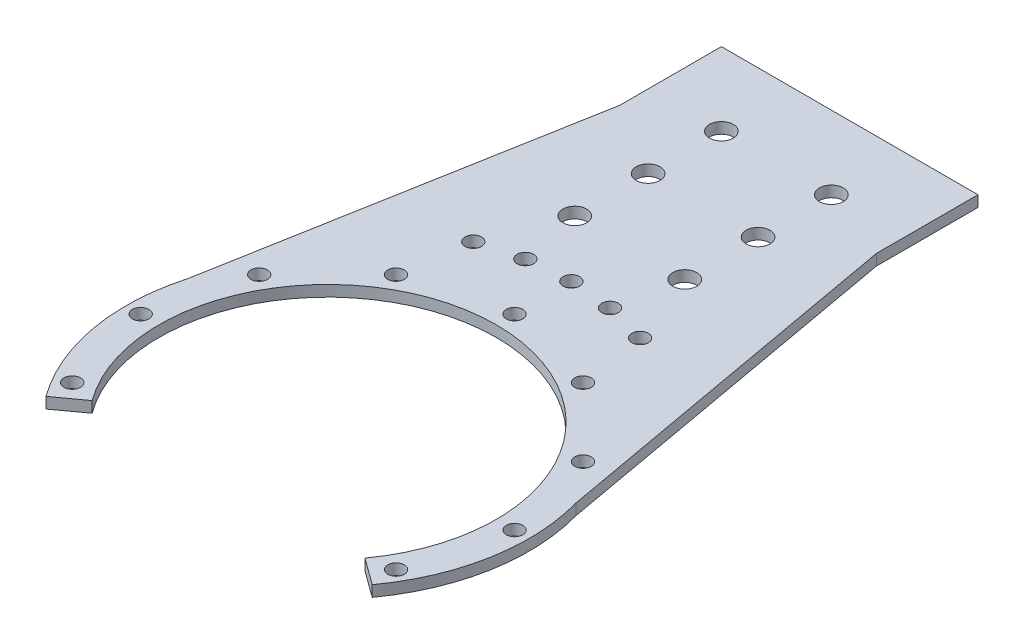
ISO-10303-21;
HEADER;
FILE_DESCRIPTION(('STEP AP214'),'2;1');
FILE_NAME('part.step','',(''),(''),'','','');
FILE_SCHEMA(('AUTOMOTIVE_DESIGN { 1 0 10303 214 1 1 1 1 }'));
ENDSEC;
DATA;
#1=APPLICATION_CONTEXT('core data for automotive mechanical design processes');
#2=APPLICATION_PROTOCOL_DEFINITION('international standard','automotive_design',2000,#1);
#3=PRODUCT_CONTEXT('',#1,'mechanical');
#4=PRODUCT('Part','Part','',(#3));
#5=PRODUCT_RELATED_PRODUCT_CATEGORY('part','',(#4));
#6=PRODUCT_DEFINITION_FORMATION('','',#4);
#7=PRODUCT_DEFINITION_CONTEXT('part definition',#1,'design');
#8=PRODUCT_DEFINITION('design','',#6,#7);
#9=PRODUCT_DEFINITION_SHAPE('','',#8);
#10=(LENGTH_UNIT() NAMED_UNIT(*) SI_UNIT(.MILLI.,.METRE.));
#11=(NAMED_UNIT(*) PLANE_ANGLE_UNIT() SI_UNIT($,.RADIAN.));
#12=(NAMED_UNIT(*) SI_UNIT($,.STERADIAN.) SOLID_ANGLE_UNIT());
#13=UNCERTAINTY_MEASURE_WITH_UNIT(LENGTH_MEASURE(1.E-05),#10,'distance_accuracy_value','');
#14=(GEOMETRIC_REPRESENTATION_CONTEXT(3) GLOBAL_UNCERTAINTY_ASSIGNED_CONTEXT((#13)) GLOBAL_UNIT_ASSIGNED_CONTEXT((#10,
#11,#12)) REPRESENTATION_CONTEXT('',''));
#15=CARTESIAN_POINT('',(0.,0.,0.));
#16=DIRECTION('',(0.,0.,1.));
#17=DIRECTION('',(1.,0.,0.));
#18=AXIS2_PLACEMENT_3D('',#15,#16,#17);
#19=CARTESIAN_POINT('',(-15.,-0.000287499999999594,-82.4264068711929));
#20=DIRECTION('',(0.,1.,0.));
#21=DIRECTION('',(0.,0.,1.));
#22=AXIS2_PLACEMENT_3D('',#19,#20,#21);
#23=CYLINDRICAL_SURFACE('',#22,3.25);
#24=CARTESIAN_POINT('',(-15.,3.,-82.4264068711929));
#25=DIRECTION('',(0.,1.,0.));
#26=DIRECTION('',(0.,0.,1.));
#27=AXIS2_PLACEMENT_3D('',#24,#25,#26);
#28=CIRCLE('',#27,3.25);
#29=CARTESIAN_POINT('',(-15.,3.,-79.1764068711929));
#30=VERTEX_POINT('',#29);
#31=EDGE_CURVE('E41',#30,#30,#28,.T.);
#32=ORIENTED_EDGE('',*,*,#31,.T.);
#33=EDGE_LOOP('',(#32));
#34=FACE_BOUND('',#33,.T.);
#35=CARTESIAN_POINT('',(-15.,0.,-82.4264068711929));
#36=DIRECTION('',(0.,1.,0.));
#37=DIRECTION('',(0.,0.,1.));
#38=AXIS2_PLACEMENT_3D('',#35,#36,#37);
#39=CIRCLE('',#38,3.25);
#40=CARTESIAN_POINT('',(-15.,0.,-79.1764068711929));
#41=VERTEX_POINT('',#40);
#42=EDGE_CURVE('E11',#41,#41,#39,.T.);
#43=ORIENTED_EDGE('',*,*,#42,.F.);
#44=EDGE_LOOP('',(#43));
#45=FACE_BOUND('',#44,.T.);
#46=ADVANCED_FACE('F33',(#34,#45),#23,.F.);
#47=CARTESIAN_POINT('',(15.,-0.000287499999999594,-82.4264068711929));
#48=DIRECTION('',(0.,1.,0.));
#49=DIRECTION('',(0.,0.,1.));
#50=AXIS2_PLACEMENT_3D('',#47,#48,#49);
#51=CYLINDRICAL_SURFACE('',#50,3.25);
#52=CARTESIAN_POINT('',(15.,3.,-82.4264068711929));
#53=DIRECTION('',(0.,1.,0.));
#54=DIRECTION('',(0.,0.,1.));
#55=AXIS2_PLACEMENT_3D('',#52,#53,#54);
#56=CIRCLE('',#55,3.25);
#57=CARTESIAN_POINT('',(15.,3.,-79.1764068711929));
#58=VERTEX_POINT('',#57);
#59=EDGE_CURVE('E159',#58,#58,#56,.T.);
#60=ORIENTED_EDGE('',*,*,#59,.T.);
#61=EDGE_LOOP('',(#60));
#62=FACE_BOUND('',#61,.T.);
#63=CARTESIAN_POINT('',(15.,0.,-82.4264068711929));
#64=DIRECTION('',(0.,1.,0.));
#65=DIRECTION('',(0.,0.,1.));
#66=AXIS2_PLACEMENT_3D('',#63,#64,#65);
#67=CIRCLE('',#66,3.25);
#68=CARTESIAN_POINT('',(15.,0.,-79.1764068711929));
#69=VERTEX_POINT('',#68);
#70=EDGE_CURVE('E161',#69,#69,#67,.T.);
#71=ORIENTED_EDGE('',*,*,#70,.F.);
#72=EDGE_LOOP('',(#71));
#73=FACE_BOUND('',#72,.T.);
#74=ADVANCED_FACE('F356',(#62,#73),#51,.F.);
#75=CARTESIAN_POINT('',(0.,3.,0.));
#76=DIRECTION('',(0.,-1.,0.));
#77=DIRECTION('',(0.,0.,-1.));
#78=AXIS2_PLACEMENT_3D('',#75,#76,#77);
#79=CYLINDRICAL_SURFACE('',#78,55.);
#80=DIRECTION('',(0.,1.,0.));
#81=VECTOR('',#80,1.);
#82=CARTESIAN_POINT('',(44.4959346906222,-2.49999999998515E-05,32.328188876086));
#83=LINE('',#82,#81);
#84=CARTESIAN_POINT('',(44.4959346906222,-6.24999999996288E-06,32.328188876086));
#85=VERTEX_POINT('',#84);
#86=CARTESIAN_POINT('',(44.4959346906222,3.,32.328188876086));
#87=VERTEX_POINT('',#86);
#88=EDGE_CURVE('E111',#85,#87,#83,.T.);
#89=ORIENTED_EDGE('',*,*,#88,.F.);
#90=CARTESIAN_POINT('',(0.,0.,0.));
#91=DIRECTION('',(0.,1.,0.));
#92=DIRECTION('',(0.,0.,1.));
#93=AXIS2_PLACEMENT_3D('',#90,#91,#92);
#94=CIRCLE('',#93,55.);
#95=CARTESIAN_POINT('',(52.9848805263081,0.,-14.7513536874709));
#96=VERTEX_POINT('',#95);
#97=EDGE_CURVE('E141',#85,#96,#94,.T.);
#98=ORIENTED_EDGE('',*,*,#97,.T.);
#99=DIRECTION('',(0.,-1.,0.));
#100=VECTOR('',#99,1.);
#101=CARTESIAN_POINT('',(52.9848805263081,3.,-14.7513536874709));
#102=LINE('',#101,#100);
#103=CARTESIAN_POINT('',(52.9848805263081,3.,-14.7513536874709));
#104=VERTEX_POINT('',#103);
#105=EDGE_CURVE('E132',#104,#96,#102,.T.);
#106=ORIENTED_EDGE('',*,*,#105,.F.);
#107=CARTESIAN_POINT('',(0.,3.,0.));
#108=DIRECTION('',(0.,1.,0.));
#109=DIRECTION('',(0.,0.,1.));
#110=AXIS2_PLACEMENT_3D('',#107,#108,#109);
#111=CIRCLE('',#110,55.);
#112=EDGE_CURVE('E124',#87,#104,#111,.T.);
#113=ORIENTED_EDGE('',*,*,#112,.F.);
#114=EDGE_LOOP('',(#89,#98,#106,#113));
#115=FACE_BOUND('',#114,.T.);
#116=ADVANCED_FACE('F130',(#115),#79,.T.);
#117=CARTESIAN_POINT('',(0.,3.,0.));
#118=DIRECTION('',(0.,1.,0.));
#119=DIRECTION('',(0.,0.,1.));
#120=AXIS2_PLACEMENT_3D('',#117,#118,#119);
#121=PLANE('',#120);
#122=CARTESIAN_POINT('',(22.744339531157,3.,-62.4895592822629));
#123=DIRECTION('',(0.,1.,0.));
#124=DIRECTION('',(0.,0.,1.));
#125=AXIS2_PLACEMENT_3D('',#122,#123,#124);
#126=CIRCLE('',#125,2.25);
#127=CARTESIAN_POINT('',(22.744339531157,3.,-60.2395592822629));
#128=VERTEX_POINT('',#127);
#129=EDGE_CURVE('E177',#128,#128,#126,.T.);
#130=ORIENTED_EDGE('',*,*,#129,.F.);
#131=EDGE_LOOP('',(#130));
#132=FACE_BOUND('',#131,.T.);
#133=CARTESIAN_POINT('',(11.5476038148509,3.,-65.4897155753118));
#134=DIRECTION('',(0.,1.,0.));
#135=DIRECTION('',(0.,0.,1.));
#136=AXIS2_PLACEMENT_3D('',#133,#134,#135);
#137=CIRCLE('',#136,2.25);
#138=CARTESIAN_POINT('',(11.5476038148509,3.,-63.2397155753118));
#139=VERTEX_POINT('',#138);
#140=EDGE_CURVE('E187',#139,#139,#137,.T.);
#141=ORIENTED_EDGE('',*,*,#140,.F.);
#142=EDGE_LOOP('',(#141));
#143=FACE_BOUND('',#142,.T.);
#144=CARTESIAN_POINT('',(-22.744339531157,3.,-62.4895592822629));
#145=DIRECTION('',(0.,1.,0.));
#146=DIRECTION('',(0.,0.,1.));
#147=AXIS2_PLACEMENT_3D('',#144,#145,#146);
#148=CIRCLE('',#147,2.25);
#149=CARTESIAN_POINT('',(-22.744339531157,3.,-60.2395592822629));
#150=VERTEX_POINT('',#149);
#151=EDGE_CURVE('E184',#150,#150,#148,.T.);
#152=ORIENTED_EDGE('',*,*,#151,.F.);
#153=EDGE_LOOP('',(#152));
#154=FACE_BOUND('',#153,.T.);
#155=CARTESIAN_POINT('',(-11.5476038148509,3.,-65.4897155753118));
#156=DIRECTION('',(0.,1.,0.));
#157=DIRECTION('',(0.,0.,1.));
#158=AXIS2_PLACEMENT_3D('',#155,#156,#157);
#159=CIRCLE('',#158,2.25);
#160=CARTESIAN_POINT('',(-11.5476038148509,3.,-63.2397155753118));
#161=VERTEX_POINT('',#160);
#162=EDGE_CURVE('E181',#161,#161,#159,.T.);
#163=ORIENTED_EDGE('',*,*,#162,.F.);
#164=EDGE_LOOP('',(#163));
#165=FACE_BOUND('',#164,.T.);
#166=CARTESIAN_POINT('',(0.,3.,-66.5));
#167=DIRECTION('',(0.,1.,0.));
#168=DIRECTION('',(0.,0.,1.));
#169=AXIS2_PLACEMENT_3D('',#166,#167,#168);
#170=CIRCLE('',#169,2.25);
#171=CARTESIAN_POINT('',(0.,3.,-64.25));
#172=VERTEX_POINT('',#171);
#173=EDGE_CURVE('E176',#172,#172,#170,.T.);
#174=ORIENTED_EDGE('',*,*,#173,.F.);
#175=EDGE_LOOP('',(#174));
#176=FACE_BOUND('',#175,.T.);
#177=CARTESIAN_POINT('',(-15.,3.,-102.426406871193));
#178=DIRECTION('',(0.,1.,0.));
#179=DIRECTION('',(0.,0.,1.));
#180=AXIS2_PLACEMENT_3D('',#177,#178,#179);
#181=CIRCLE('',#180,3.25);
#182=CARTESIAN_POINT('',(-15.,3.,-99.1764068711929));
#183=VERTEX_POINT('',#182);
#184=EDGE_CURVE('E202',#183,#183,#181,.T.);
#185=ORIENTED_EDGE('',*,*,#184,.F.);
#186=EDGE_LOOP('',(#185));
#187=FACE_BOUND('',#186,.T.);
#188=CARTESIAN_POINT('',(15.,3.,-102.426406871193));
#189=DIRECTION('',(0.,1.,0.));
#190=DIRECTION('',(0.,0.,1.));
#191=AXIS2_PLACEMENT_3D('',#188,#189,#190);
#192=CIRCLE('',#191,3.25);
#193=CARTESIAN_POINT('',(15.,3.,-99.1764068711929));
#194=VERTEX_POINT('',#193);
#195=EDGE_CURVE('E208',#194,#194,#192,.T.);
#196=ORIENTED_EDGE('',*,*,#195,.F.);
#197=EDGE_LOOP('',(#196));
#198=FACE_BOUND('',#197,.T.);
#199=CARTESIAN_POINT('',(15.,3.,-122.426406871193));
#200=DIRECTION('',(0.,1.,0.));
#201=DIRECTION('',(0.,0.,1.));
#202=AXIS2_PLACEMENT_3D('',#199,#200,#201);
#203=CIRCLE('',#202,3.25);
#204=CARTESIAN_POINT('',(15.,3.,-119.176406871193));
#205=VERTEX_POINT('',#204);
#206=EDGE_CURVE('E218',#205,#205,#203,.T.);
#207=ORIENTED_EDGE('',*,*,#206,.F.);
#208=EDGE_LOOP('',(#207));
#209=FACE_BOUND('',#208,.T.);
#210=CARTESIAN_POINT('',(-15.,3.,-122.426406871193));
#211=DIRECTION('',(0.,1.,0.));
#212=DIRECTION('',(0.,0.,1.));
#213=AXIS2_PLACEMENT_3D('',#210,#211,#212);
#214=CIRCLE('',#213,3.25);
#215=CARTESIAN_POINT('',(-15.,3.,-119.176406871193));
#216=VERTEX_POINT('',#215);
#217=EDGE_CURVE('E215',#216,#216,#214,.T.);
#218=ORIENTED_EDGE('',*,*,#217,.F.);
#219=EDGE_LOOP('',(#218));
#220=FACE_BOUND('',#219,.T.);
#221=CARTESIAN_POINT('',(-44.1672955930064,3.,-25.4999999999999));
#222=DIRECTION('',(0.,1.,0.));
#223=DIRECTION('',(0.,0.,1.));
#224=AXIS2_PLACEMENT_3D('',#221,#222,#223);
#225=CIRCLE('',#224,2.25);
#226=CARTESIAN_POINT('',(-44.1672955930064,3.,-23.2499999999999));
#227=VERTEX_POINT('',#226);
#228=EDGE_CURVE('E250',#227,#227,#225,.T.);
#229=ORIENTED_EDGE('',*,*,#228,.F.);
#230=EDGE_LOOP('',(#229));
#231=FACE_BOUND('',#230,.T.);
#232=CARTESIAN_POINT('',(-51.,3.,1.78065548281E-13));
#233=DIRECTION('',(0.,1.,0.));
#234=DIRECTION('',(0.,0.,1.));
#235=AXIS2_PLACEMENT_3D('',#232,#233,#234);
#236=CIRCLE('',#235,2.25);
#237=CARTESIAN_POINT('',(-51.,3.,2.25000000000018));
#238=VERTEX_POINT('',#237);
#239=EDGE_CURVE('E246',#238,#238,#236,.T.);
#240=ORIENTED_EDGE('',*,*,#239,.F.);
#241=EDGE_LOOP('',(#240));
#242=FACE_BOUND('',#241,.T.);
#243=CARTESIAN_POINT('',(-44.1672955930063,3.,25.5000000000002));
#244=DIRECTION('',(0.,1.,0.));
#245=DIRECTION('',(0.,0.,1.));
#246=AXIS2_PLACEMENT_3D('',#243,#244,#245);
#247=CIRCLE('',#246,2.25);
#248=CARTESIAN_POINT('',(-44.1672955930063,3.,27.7500000000002));
#249=VERTEX_POINT('',#248);
#250=EDGE_CURVE('E242',#249,#249,#247,.T.);
#251=ORIENTED_EDGE('',*,*,#250,.F.);
#252=EDGE_LOOP('',(#251));
#253=FACE_BOUND('',#252,.T.);
#254=CARTESIAN_POINT('',(44.1672955930066,3.,25.4999999999996));
#255=DIRECTION('',(0.,1.,0.));
#256=DIRECTION('',(0.,0.,1.));
#257=AXIS2_PLACEMENT_3D('',#254,#255,#256);
#258=CIRCLE('',#257,2.25);
#259=CARTESIAN_POINT('',(44.1672955930066,3.,27.7499999999996));
#260=VERTEX_POINT('',#259);
#261=EDGE_CURVE('E238',#260,#260,#258,.T.);
#262=ORIENTED_EDGE('',*,*,#261,.F.);
#263=EDGE_LOOP('',(#262));
#264=FACE_BOUND('',#263,.T.);
#265=CARTESIAN_POINT('',(51.,3.,-5.34196644842999E-13));
#266=DIRECTION('',(0.,1.,0.));
#267=DIRECTION('',(0.,0.,1.));
#268=AXIS2_PLACEMENT_3D('',#265,#266,#267);
#269=CIRCLE('',#268,2.25);
#270=CARTESIAN_POINT('',(51.,3.,2.24999999999947));
#271=VERTEX_POINT('',#270);
#272=EDGE_CURVE('E234',#271,#271,#269,.T.);
#273=ORIENTED_EDGE('',*,*,#272,.F.);
#274=EDGE_LOOP('',(#273));
#275=FACE_BOUND('',#274,.T.);
#276=CARTESIAN_POINT('',(44.1672955930061,3.,-25.5000000000005));
#277=DIRECTION('',(0.,1.,0.));
#278=DIRECTION('',(0.,0.,1.));
#279=AXIS2_PLACEMENT_3D('',#276,#277,#278);
#280=CIRCLE('',#279,2.25);
#281=CARTESIAN_POINT('',(44.1672955930061,3.,-23.2500000000005));
#282=VERTEX_POINT('',#281);
#283=EDGE_CURVE('E230',#282,#282,#280,.T.);
#284=ORIENTED_EDGE('',*,*,#283,.F.);
#285=EDGE_LOOP('',(#284));
#286=FACE_BOUND('',#285,.T.);
#287=CARTESIAN_POINT('',(25.4999999999994,3.,-44.1672955930067));
#288=DIRECTION('',(0.,1.,0.));
#289=DIRECTION('',(0.,0.,1.));
#290=AXIS2_PLACEMENT_3D('',#287,#288,#289);
#291=CIRCLE('',#290,2.25);
#292=CARTESIAN_POINT('',(25.4999999999994,3.,-41.9172955930067));
#293=VERTEX_POINT('',#292);
#294=EDGE_CURVE('E226',#293,#293,#291,.T.);
#295=ORIENTED_EDGE('',*,*,#294,.F.);
#296=EDGE_LOOP('',(#295));
#297=FACE_BOUND('',#296,.T.);
#298=CARTESIAN_POINT('',(-25.5,3.,-44.1672955930063));
#299=DIRECTION('',(0.,1.,0.));
#300=DIRECTION('',(0.,0.,1.));
#301=AXIS2_PLACEMENT_3D('',#298,#299,#300);
#302=CIRCLE('',#301,2.25);
#303=CARTESIAN_POINT('',(-25.5,3.,-41.9172955930063));
#304=VERTEX_POINT('',#303);
#305=EDGE_CURVE('E222',#304,#304,#302,.T.);
#306=ORIENTED_EDGE('',*,*,#305,.F.);
#307=EDGE_LOOP('',(#306));
#308=FACE_BOUND('',#307,.T.);
#309=CARTESIAN_POINT('',(0.,3.,-51.));
#310=DIRECTION('',(0.,1.,0.));
#311=DIRECTION('',(0.,0.,1.));
#312=AXIS2_PLACEMENT_3D('',#309,#310,#311);
#313=CIRCLE('',#312,2.25);
#314=CARTESIAN_POINT('',(0.,3.,-48.75));
#315=VERTEX_POINT('',#314);
#316=EDGE_CURVE('E117',#315,#315,#313,.T.);
#317=ORIENTED_EDGE('',*,*,#316,.F.);
#318=EDGE_LOOP('',(#317));
#319=FACE_BOUND('',#318,.T.);
#320=CARTESIAN_POINT('',(0.,3.,0.));
#321=DIRECTION('',(0.,1.,0.));
#322=DIRECTION('',(0.,0.,1.));
#323=AXIS2_PLACEMENT_3D('',#320,#321,#322);
#324=CIRCLE('',#323,46.);
#325=CARTESIAN_POINT('',(37.2147817412476,3.,27.0381216054537));
#326=VERTEX_POINT('',#325);
#327=CARTESIAN_POINT('',(-37.2147817412476,3.,27.0381216054537));
#328=VERTEX_POINT('',#327);
#329=EDGE_CURVE('E127',#326,#328,#324,.T.);
#330=ORIENTED_EDGE('',*,*,#329,.F.);
#331=DIRECTION('',(0.809016994374949,0.,0.587785252292472));
#332=VECTOR('',#331,1.);
#333=CARTESIAN_POINT('',(0.,3.,0.));
#334=LINE('',#333,#332);
#335=EDGE_CURVE('E49',#326,#87,#334,.T.);
#336=ORIENTED_EDGE('',*,*,#335,.T.);
#337=ORIENTED_EDGE('',*,*,#112,.T.);
#338=DIRECTION('',(0.177060394607424,0.,0.984199988143397));
#339=VECTOR('',#338,1.);
#340=CARTESIAN_POINT('',(35.,3.,-114.721305974083));
#341=LINE('',#340,#339);
#342=CARTESIAN_POINT('',(35.,3.,-114.721305974083));
#343=VERTEX_POINT('',#342);
#344=EDGE_CURVE('E272',#343,#104,#341,.T.);
#345=ORIENTED_EDGE('',*,*,#344,.F.);
#346=DIRECTION('',(0.,0.,-1.));
#347=VECTOR('',#346,1.);
#348=CARTESIAN_POINT('',(35.,3.,-142.426406871193));
#349=LINE('',#348,#347);
#350=CARTESIAN_POINT('',(35.,3.,-142.426406871193));
#351=VERTEX_POINT('',#350);
#352=EDGE_CURVE('E299',#343,#351,#349,.T.);
#353=ORIENTED_EDGE('',*,*,#352,.T.);
#354=DIRECTION('',(-1.,0.,0.));
#355=VECTOR('',#354,1.);
#356=CARTESIAN_POINT('',(-35.,3.,-142.426406871193));
#357=LINE('',#356,#355);
#358=CARTESIAN_POINT('',(-35.,3.,-142.426406871193));
#359=VERTEX_POINT('',#358);
#360=EDGE_CURVE('E292',#351,#359,#357,.T.);
#361=ORIENTED_EDGE('',*,*,#360,.T.);
#362=DIRECTION('',(0.,0.,1.));
#363=VECTOR('',#362,1.);
#364=CARTESIAN_POINT('',(-35.,3.,-142.426406871193));
#365=LINE('',#364,#363);
#366=CARTESIAN_POINT('',(-35.,3.,-114.721305974083));
#367=VERTEX_POINT('',#366);
#368=EDGE_CURVE('E295',#359,#367,#365,.T.);
#369=ORIENTED_EDGE('',*,*,#368,.T.);
#370=DIRECTION('',(-0.177060394607424,0.,0.984199988143397));
#371=VECTOR('',#370,1.);
#372=CARTESIAN_POINT('',(-35.,3.,-114.721305974083));
#373=LINE('',#372,#371);
#374=CARTESIAN_POINT('',(-52.9848805263081,3.,-14.7513536874709));
#375=VERTEX_POINT('',#374);
#376=EDGE_CURVE('E281',#367,#375,#373,.T.);
#377=ORIENTED_EDGE('',*,*,#376,.T.);
#378=CARTESIAN_POINT('',(-44.4959346906222,3.,32.328188876086));
#379=VERTEX_POINT('',#378);
#380=EDGE_CURVE('E134',#375,#379,#111,.T.);
#381=ORIENTED_EDGE('',*,*,#380,.T.);
#382=DIRECTION('',(-0.809016994374949,0.,0.587785252292472));
#383=VECTOR('',#382,1.);
#384=CARTESIAN_POINT('',(0.,3.,0.));
#385=LINE('',#384,#383);
#386=EDGE_CURVE('E263',#328,#379,#385,.T.);
#387=ORIENTED_EDGE('',*,*,#386,.F.);
#388=EDGE_LOOP('',(#330,#336,#337,#345,#353,#361,#369,#377,#381,#387));
#389=FACE_BOUND('',#388,.T.);
#390=ORIENTED_EDGE('',*,*,#59,.F.);
#391=EDGE_LOOP('',(#390));
#392=FACE_BOUND('',#391,.T.);
#393=ORIENTED_EDGE('',*,*,#31,.F.);
#394=EDGE_LOOP('',(#393));
#395=FACE_BOUND('',#394,.T.);
#396=ADVANCED_FACE('F121',(#132,#143,#154,#165,#176,#187,#198,#209,#220,#231,#242,#253,#264,
#275,#286,#297,#308,#319,#389,#392,#395),#121,.T.);
#397=CARTESIAN_POINT('',(0.,0.,0.));
#398=DIRECTION('',(0.,1.,0.));
#399=DIRECTION('',(0.,0.,1.));
#400=AXIS2_PLACEMENT_3D('',#397,#398,#399);
#401=PLANE('',#400);
#402=CARTESIAN_POINT('',(22.744339531157,0.,-62.4895592822629));
#403=DIRECTION('',(0.,1.,0.));
#404=DIRECTION('',(0.,0.,1.));
#405=AXIS2_PLACEMENT_3D('',#402,#403,#404);
#406=CIRCLE('',#405,2.25);
#407=CARTESIAN_POINT('',(22.744339531157,0.,-60.2395592822629));
#408=VERTEX_POINT('',#407);
#409=EDGE_CURVE('E36',#408,#408,#406,.T.);
#410=ORIENTED_EDGE('',*,*,#409,.T.);
#411=EDGE_LOOP('',(#410));
#412=FACE_BOUND('',#411,.T.);
#413=CARTESIAN_POINT('',(11.5476038148509,0.,-65.4897155753118));
#414=DIRECTION('',(0.,1.,0.));
#415=DIRECTION('',(0.,0.,1.));
#416=AXIS2_PLACEMENT_3D('',#413,#414,#415);
#417=CIRCLE('',#416,2.25);
#418=CARTESIAN_POINT('',(11.5476038148509,0.,-63.2397155753118));
#419=VERTEX_POINT('',#418);
#420=EDGE_CURVE('E185',#419,#419,#417,.T.);
#421=ORIENTED_EDGE('',*,*,#420,.T.);
#422=EDGE_LOOP('',(#421));
#423=FACE_BOUND('',#422,.T.);
#424=CARTESIAN_POINT('',(-22.744339531157,0.,-62.4895592822629));
#425=DIRECTION('',(0.,1.,0.));
#426=DIRECTION('',(0.,0.,1.));
#427=AXIS2_PLACEMENT_3D('',#424,#425,#426);
#428=CIRCLE('',#427,2.25);
#429=CARTESIAN_POINT('',(-22.744339531157,0.,-60.2395592822629));
#430=VERTEX_POINT('',#429);
#431=EDGE_CURVE('E182',#430,#430,#428,.T.);
#432=ORIENTED_EDGE('',*,*,#431,.T.);
#433=EDGE_LOOP('',(#432));
#434=FACE_BOUND('',#433,.T.);
#435=CARTESIAN_POINT('',(-11.5476038148509,0.,-65.4897155753118));
#436=DIRECTION('',(0.,1.,0.));
#437=DIRECTION('',(0.,0.,1.));
#438=AXIS2_PLACEMENT_3D('',#435,#436,#437);
#439=CIRCLE('',#438,2.25);
#440=CARTESIAN_POINT('',(-11.5476038148509,0.,-63.2397155753118));
#441=VERTEX_POINT('',#440);
#442=EDGE_CURVE('E178',#441,#441,#439,.T.);
#443=ORIENTED_EDGE('',*,*,#442,.T.);
#444=EDGE_LOOP('',(#443));
#445=FACE_BOUND('',#444,.T.);
#446=CARTESIAN_POINT('',(0.,0.,-66.5));
#447=DIRECTION('',(0.,1.,0.));
#448=DIRECTION('',(0.,0.,1.));
#449=AXIS2_PLACEMENT_3D('',#446,#447,#448);
#450=CIRCLE('',#449,2.25);
#451=CARTESIAN_POINT('',(0.,0.,-64.25));
#452=VERTEX_POINT('',#451);
#453=EDGE_CURVE('E173',#452,#452,#450,.T.);
#454=ORIENTED_EDGE('',*,*,#453,.T.);
#455=EDGE_LOOP('',(#454));
#456=FACE_BOUND('',#455,.T.);
#457=CARTESIAN_POINT('',(-15.,0.,-102.426406871193));
#458=DIRECTION('',(0.,1.,0.));
#459=DIRECTION('',(0.,0.,1.));
#460=AXIS2_PLACEMENT_3D('',#457,#458,#459);
#461=CIRCLE('',#460,3.25);
#462=CARTESIAN_POINT('',(-15.,0.,-99.1764068711929));
#463=VERTEX_POINT('',#462);
#464=EDGE_CURVE('E205',#463,#463,#461,.T.);
#465=ORIENTED_EDGE('',*,*,#464,.T.);
#466=EDGE_LOOP('',(#465));
#467=FACE_BOUND('',#466,.T.);
#468=CARTESIAN_POINT('',(15.,0.,-102.426406871193));
#469=DIRECTION('',(0.,1.,0.));
#470=DIRECTION('',(0.,0.,1.));
#471=AXIS2_PLACEMENT_3D('',#468,#469,#470);
#472=CIRCLE('',#471,3.25);
#473=CARTESIAN_POINT('',(15.,0.,-99.1764068711929));
#474=VERTEX_POINT('',#473);
#475=EDGE_CURVE('E211',#474,#474,#472,.T.);
#476=ORIENTED_EDGE('',*,*,#475,.T.);
#477=EDGE_LOOP('',(#476));
#478=FACE_BOUND('',#477,.T.);
#479=CARTESIAN_POINT('',(15.,0.,-122.426406871193));
#480=DIRECTION('',(0.,1.,0.));
#481=DIRECTION('',(0.,0.,1.));
#482=AXIS2_PLACEMENT_3D('',#479,#480,#481);
#483=CIRCLE('',#482,3.25);
#484=CARTESIAN_POINT('',(15.,0.,-119.176406871193));
#485=VERTEX_POINT('',#484);
#486=EDGE_CURVE('E168',#485,#485,#483,.T.);
#487=ORIENTED_EDGE('',*,*,#486,.T.);
#488=EDGE_LOOP('',(#487));
#489=FACE_BOUND('',#488,.T.);
#490=CARTESIAN_POINT('',(-15.,0.,-122.426406871193));
#491=DIRECTION('',(0.,1.,0.));
#492=DIRECTION('',(0.,0.,1.));
#493=AXIS2_PLACEMENT_3D('',#490,#491,#492);
#494=CIRCLE('',#493,3.25);
#495=CARTESIAN_POINT('',(-15.,0.,-119.176406871193));
#496=VERTEX_POINT('',#495);
#497=EDGE_CURVE('E214',#496,#496,#494,.T.);
#498=ORIENTED_EDGE('',*,*,#497,.T.);
#499=EDGE_LOOP('',(#498));
#500=FACE_BOUND('',#499,.T.);
#501=CARTESIAN_POINT('',(-44.1672955930064,0.,-25.4999999999999));
#502=DIRECTION('',(0.,1.,0.));
#503=DIRECTION('',(0.,0.,1.));
#504=AXIS2_PLACEMENT_3D('',#501,#502,#503);
#505=CIRCLE('',#504,2.25);
#506=CARTESIAN_POINT('',(-44.1672955930064,0.,-23.2499999999999));
#507=VERTEX_POINT('',#506);
#508=EDGE_CURVE('E249',#507,#507,#505,.T.);
#509=ORIENTED_EDGE('',*,*,#508,.T.);
#510=EDGE_LOOP('',(#509));
#511=FACE_BOUND('',#510,.T.);
#512=CARTESIAN_POINT('',(-51.,0.,1.78065548281E-13));
#513=DIRECTION('',(0.,1.,0.));
#514=DIRECTION('',(0.,0.,1.));
#515=AXIS2_PLACEMENT_3D('',#512,#513,#514);
#516=CIRCLE('',#515,2.25);
#517=CARTESIAN_POINT('',(-51.,0.,2.25000000000018));
#518=VERTEX_POINT('',#517);
#519=EDGE_CURVE('E245',#518,#518,#516,.T.);
#520=ORIENTED_EDGE('',*,*,#519,.T.);
#521=EDGE_LOOP('',(#520));
#522=FACE_BOUND('',#521,.T.);
#523=CARTESIAN_POINT('',(-44.1672955930063,0.,25.5000000000002));
#524=DIRECTION('',(0.,1.,0.));
#525=DIRECTION('',(0.,0.,1.));
#526=AXIS2_PLACEMENT_3D('',#523,#524,#525);
#527=CIRCLE('',#526,2.25);
#528=CARTESIAN_POINT('',(-44.1672955930063,0.,27.7500000000002));
#529=VERTEX_POINT('',#528);
#530=EDGE_CURVE('E241',#529,#529,#527,.T.);
#531=ORIENTED_EDGE('',*,*,#530,.T.);
#532=EDGE_LOOP('',(#531));
#533=FACE_BOUND('',#532,.T.);
#534=CARTESIAN_POINT('',(44.1672955930066,0.,25.4999999999996));
#535=DIRECTION('',(0.,1.,0.));
#536=DIRECTION('',(0.,0.,1.));
#537=AXIS2_PLACEMENT_3D('',#534,#535,#536);
#538=CIRCLE('',#537,2.25);
#539=CARTESIAN_POINT('',(44.1672955930066,0.,27.7499999999996));
#540=VERTEX_POINT('',#539);
#541=EDGE_CURVE('E237',#540,#540,#538,.T.);
#542=ORIENTED_EDGE('',*,*,#541,.T.);
#543=EDGE_LOOP('',(#542));
#544=FACE_BOUND('',#543,.T.);
#545=CARTESIAN_POINT('',(51.,0.,-5.34196644842999E-13));
#546=DIRECTION('',(0.,1.,0.));
#547=DIRECTION('',(0.,0.,1.));
#548=AXIS2_PLACEMENT_3D('',#545,#546,#547);
#549=CIRCLE('',#548,2.25);
#550=CARTESIAN_POINT('',(51.,0.,2.24999999999947));
#551=VERTEX_POINT('',#550);
#552=EDGE_CURVE('E233',#551,#551,#549,.T.);
#553=ORIENTED_EDGE('',*,*,#552,.T.);
#554=EDGE_LOOP('',(#553));
#555=FACE_BOUND('',#554,.T.);
#556=CARTESIAN_POINT('',(44.1672955930061,0.,-25.5000000000005));
#557=DIRECTION('',(0.,1.,0.));
#558=DIRECTION('',(0.,0.,1.));
#559=AXIS2_PLACEMENT_3D('',#556,#557,#558);
#560=CIRCLE('',#559,2.25);
#561=CARTESIAN_POINT('',(44.1672955930061,0.,-23.2500000000005));
#562=VERTEX_POINT('',#561);
#563=EDGE_CURVE('E229',#562,#562,#560,.T.);
#564=ORIENTED_EDGE('',*,*,#563,.T.);
#565=EDGE_LOOP('',(#564));
#566=FACE_BOUND('',#565,.T.);
#567=CARTESIAN_POINT('',(25.4999999999994,0.,-44.1672955930067));
#568=DIRECTION('',(0.,1.,0.));
#569=DIRECTION('',(0.,0.,1.));
#570=AXIS2_PLACEMENT_3D('',#567,#568,#569);
#571=CIRCLE('',#570,2.25);
#572=CARTESIAN_POINT('',(25.4999999999994,0.,-41.9172955930067));
#573=VERTEX_POINT('',#572);
#574=EDGE_CURVE('E225',#573,#573,#571,.T.);
#575=ORIENTED_EDGE('',*,*,#574,.T.);
#576=EDGE_LOOP('',(#575));
#577=FACE_BOUND('',#576,.T.);
#578=CARTESIAN_POINT('',(-25.5,0.,-44.1672955930063));
#579=DIRECTION('',(0.,1.,0.));
#580=DIRECTION('',(0.,0.,1.));
#581=AXIS2_PLACEMENT_3D('',#578,#579,#580);
#582=CIRCLE('',#581,2.25);
#583=CARTESIAN_POINT('',(-25.5,0.,-41.9172955930063));
#584=VERTEX_POINT('',#583);
#585=EDGE_CURVE('E221',#584,#584,#582,.T.);
#586=ORIENTED_EDGE('',*,*,#585,.T.);
#587=EDGE_LOOP('',(#586));
#588=FACE_BOUND('',#587,.T.);
#589=CARTESIAN_POINT('',(0.,0.,-51.));
#590=DIRECTION('',(0.,1.,0.));
#591=DIRECTION('',(0.,0.,1.));
#592=AXIS2_PLACEMENT_3D('',#589,#590,#591);
#593=CIRCLE('',#592,2.25);
#594=CARTESIAN_POINT('',(0.,0.,-48.75));
#595=VERTEX_POINT('',#594);
#596=EDGE_CURVE('E253',#595,#595,#593,.T.);
#597=ORIENTED_EDGE('',*,*,#596,.T.);
#598=EDGE_LOOP('',(#597));
#599=FACE_BOUND('',#598,.T.);
#600=DIRECTION('',(0.809016994374949,0.,0.587785252292472));
#601=VECTOR('',#600,1.);
#602=CARTESIAN_POINT('',(0.,0.,0.));
#603=LINE('',#602,#601);
#604=CARTESIAN_POINT('',(37.2147817412476,0.,27.0381216054537));
#605=VERTEX_POINT('',#604);
#606=EDGE_CURVE('E113',#605,#85,#603,.T.);
#607=ORIENTED_EDGE('',*,*,#606,.F.);
#608=CARTESIAN_POINT('',(0.,0.,0.));
#609=DIRECTION('',(0.,1.,0.));
#610=DIRECTION('',(0.,0.,1.));
#611=AXIS2_PLACEMENT_3D('',#608,#609,#610);
#612=CIRCLE('',#611,46.);
#613=CARTESIAN_POINT('',(-37.2147817412476,0.,27.0381216054537));
#614=VERTEX_POINT('',#613);
#615=EDGE_CURVE('E57',#605,#614,#612,.T.);
#616=ORIENTED_EDGE('',*,*,#615,.T.);
#617=DIRECTION('',(-0.809016994374949,0.,0.587785252292472));
#618=VECTOR('',#617,1.);
#619=CARTESIAN_POINT('',(0.,0.,0.));
#620=LINE('',#619,#618);
#621=CARTESIAN_POINT('',(-44.4959346906222,0.,32.328188876086));
#622=VERTEX_POINT('',#621);
#623=EDGE_CURVE('E128',#614,#622,#620,.T.);
#624=ORIENTED_EDGE('',*,*,#623,.T.);
#625=CARTESIAN_POINT('',(-52.9848805263081,0.,-14.7513536874709));
#626=VERTEX_POINT('',#625);
#627=EDGE_CURVE('E135',#626,#622,#94,.T.);
#628=ORIENTED_EDGE('',*,*,#627,.F.);
#629=DIRECTION('',(-0.177060394607424,0.,0.984199988143397));
#630=VECTOR('',#629,1.);
#631=CARTESIAN_POINT('',(-35.,0.,-114.721305974083));
#632=LINE('',#631,#630);
#633=CARTESIAN_POINT('',(-35.,0.,-114.721305974083));
#634=VERTEX_POINT('',#633);
#635=EDGE_CURVE('E280',#634,#626,#632,.T.);
#636=ORIENTED_EDGE('',*,*,#635,.F.);
#637=DIRECTION('',(0.,0.,1.));
#638=VECTOR('',#637,1.);
#639=CARTESIAN_POINT('',(-35.,0.,-142.426406871193));
#640=LINE('',#639,#638);
#641=CARTESIAN_POINT('',(-35.,0.,-142.426406871193));
#642=VERTEX_POINT('',#641);
#643=EDGE_CURVE('E304',#642,#634,#640,.T.);
#644=ORIENTED_EDGE('',*,*,#643,.F.);
#645=DIRECTION('',(-1.,0.,0.));
#646=VECTOR('',#645,1.);
#647=CARTESIAN_POINT('',(-35.,0.,-142.426406871193));
#648=LINE('',#647,#646);
#649=CARTESIAN_POINT('',(35.,0.,-142.426406871193));
#650=VERTEX_POINT('',#649);
#651=EDGE_CURVE('E291',#650,#642,#648,.T.);
#652=ORIENTED_EDGE('',*,*,#651,.F.);
#653=DIRECTION('',(0.,0.,-1.));
#654=VECTOR('',#653,1.);
#655=CARTESIAN_POINT('',(35.,0.,-142.426406871193));
#656=LINE('',#655,#654);
#657=CARTESIAN_POINT('',(35.,0.,-114.721305974083));
#658=VERTEX_POINT('',#657);
#659=EDGE_CURVE('E296',#658,#650,#656,.T.);
#660=ORIENTED_EDGE('',*,*,#659,.F.);
#661=DIRECTION('',(0.177060394607424,0.,0.984199988143397));
#662=VECTOR('',#661,1.);
#663=CARTESIAN_POINT('',(35.,0.,-114.721305974083));
#664=LINE('',#663,#662);
#665=EDGE_CURVE('E271',#658,#96,#664,.T.);
#666=ORIENTED_EDGE('',*,*,#665,.T.);
#667=ORIENTED_EDGE('',*,*,#97,.F.);
#668=EDGE_LOOP('',(#607,#616,#624,#628,#636,#644,#652,#660,#666,#667));
#669=FACE_BOUND('',#668,.T.);
#670=ORIENTED_EDGE('',*,*,#70,.T.);
#671=EDGE_LOOP('',(#670));
#672=FACE_BOUND('',#671,.T.);
#673=ORIENTED_EDGE('',*,*,#42,.T.);
#674=EDGE_LOOP('',(#673));
#675=FACE_BOUND('',#674,.T.);
#676=ADVANCED_FACE('F335',(#412,#423,#434,#445,#456,#467,#478,#489,#500,#511,#522,#533,#544,
#555,#566,#577,#588,#599,#669,#672,#675),#401,.F.);
#677=CARTESIAN_POINT('',(0.,0.,0.));
#678=DIRECTION('',(0.,1.,0.));
#679=DIRECTION('',(0.,0.,1.));
#680=AXIS2_PLACEMENT_3D('',#677,#678,#679);
#681=CYLINDRICAL_SURFACE('',#680,46.);
#682=DIRECTION('',(0.,1.,0.));
#683=VECTOR('',#682,1.);
#684=CARTESIAN_POINT('',(37.2147817412476,0.,27.0381216054537));
#685=LINE('',#684,#683);
#686=EDGE_CURVE('E146',#326,#605,#685,.F.);
#687=ORIENTED_EDGE('',*,*,#686,.F.);
#688=ORIENTED_EDGE('',*,*,#329,.T.);
#689=DIRECTION('',(0.,1.,0.));
#690=VECTOR('',#689,1.);
#691=CARTESIAN_POINT('',(-37.2147817412476,0.,27.0381216054537));
#692=LINE('',#691,#690);
#693=EDGE_CURVE('E138',#328,#614,#692,.F.);
#694=ORIENTED_EDGE('',*,*,#693,.T.);
#695=ORIENTED_EDGE('',*,*,#615,.F.);
#696=EDGE_LOOP('',(#687,#688,#694,#695));
#697=FACE_BOUND('',#696,.T.);
#698=ADVANCED_FACE('F366',(#697),#681,.F.);
#699=ORIENTED_EDGE('',*,*,#627,.T.);
#700=DIRECTION('',(0.,1.,0.));
#701=VECTOR('',#700,1.);
#702=CARTESIAN_POINT('',(-44.4959346906222,0.,32.328188876086));
#703=LINE('',#702,#701);
#704=EDGE_CURVE('E260',#622,#379,#703,.T.);
#705=ORIENTED_EDGE('',*,*,#704,.T.);
#706=ORIENTED_EDGE('',*,*,#380,.F.);
#707=DIRECTION('',(0.,-1.,0.));
#708=VECTOR('',#707,1.);
#709=CARTESIAN_POINT('',(-52.9848805263081,3.,-14.7513536874709));
#710=LINE('',#709,#708);
#711=EDGE_CURVE('E284',#375,#626,#710,.T.);
#712=ORIENTED_EDGE('',*,*,#711,.T.);
#713=EDGE_LOOP('',(#699,#705,#706,#712));
#714=FACE_BOUND('',#713,.T.);
#715=ADVANCED_FACE('F373',(#714),#79,.T.);
#716=CARTESIAN_POINT('',(-35.,3.,-142.426406871193));
#717=DIRECTION('',(1.,0.,0.));
#718=DIRECTION('',(0.,0.,-1.));
#719=AXIS2_PLACEMENT_3D('',#716,#717,#718);
#720=PLANE('',#719);
#721=DIRECTION('',(0.,-1.,0.));
#722=VECTOR('',#721,1.);
#723=CARTESIAN_POINT('',(-35.,3.,-114.721305974083));
#724=LINE('',#723,#722);
#725=EDGE_CURVE('E288',#367,#634,#724,.T.);
#726=ORIENTED_EDGE('',*,*,#725,.F.);
#727=ORIENTED_EDGE('',*,*,#368,.F.);
#728=DIRECTION('',(0.,-1.,0.));
#729=VECTOR('',#728,1.);
#730=CARTESIAN_POINT('',(-35.,3.,-142.426406871193));
#731=LINE('',#730,#729);
#732=EDGE_CURVE('E151',#359,#642,#731,.T.);
#733=ORIENTED_EDGE('',*,*,#732,.T.);
#734=ORIENTED_EDGE('',*,*,#643,.T.);
#735=EDGE_LOOP('',(#726,#727,#733,#734));
#736=FACE_BOUND('',#735,.T.);
#737=ADVANCED_FACE('F384',(#736),#720,.F.);
#738=CARTESIAN_POINT('',(-35.,3.,-142.426406871193));
#739=DIRECTION('',(0.,0.,1.));
#740=DIRECTION('',(1.,0.,0.));
#741=AXIS2_PLACEMENT_3D('',#738,#739,#740);
#742=PLANE('',#741);
#743=ORIENTED_EDGE('',*,*,#651,.T.);
#744=ORIENTED_EDGE('',*,*,#732,.F.);
#745=ORIENTED_EDGE('',*,*,#360,.F.);
#746=DIRECTION('',(0.,-1.,0.));
#747=VECTOR('',#746,1.);
#748=CARTESIAN_POINT('',(35.,3.,-142.426406871193));
#749=LINE('',#748,#747);
#750=EDGE_CURVE('E301',#351,#650,#749,.T.);
#751=ORIENTED_EDGE('',*,*,#750,.T.);
#752=EDGE_LOOP('',(#743,#744,#745,#751));
#753=FACE_BOUND('',#752,.T.);
#754=ADVANCED_FACE('F389',(#753),#742,.F.);
#755=CARTESIAN_POINT('',(35.,3.,-142.426406871193));
#756=DIRECTION('',(-1.,0.,0.));
#757=DIRECTION('',(0.,0.,1.));
#758=AXIS2_PLACEMENT_3D('',#755,#756,#757);
#759=PLANE('',#758);
#760=ORIENTED_EDGE('',*,*,#352,.F.);
#761=DIRECTION('',(0.,-1.,0.));
#762=VECTOR('',#761,1.);
#763=CARTESIAN_POINT('',(35.,3.,-114.721305974083));
#764=LINE('',#763,#762);
#765=EDGE_CURVE('E274',#343,#658,#764,.T.);
#766=ORIENTED_EDGE('',*,*,#765,.T.);
#767=ORIENTED_EDGE('',*,*,#659,.T.);
#768=ORIENTED_EDGE('',*,*,#750,.F.);
#769=EDGE_LOOP('',(#760,#766,#767,#768));
#770=FACE_BOUND('',#769,.T.);
#771=ADVANCED_FACE('F401',(#770),#759,.F.);
#772=CARTESIAN_POINT('',(-35.,3.,-114.721305974083));
#773=DIRECTION('',(0.984199988143397,0.,0.177060394607424));
#774=DIRECTION('',(0.177060394607424,0.,-0.984199988143397));
#775=AXIS2_PLACEMENT_3D('',#772,#773,#774);
#776=PLANE('',#775);
#777=ORIENTED_EDGE('',*,*,#635,.T.);
#778=ORIENTED_EDGE('',*,*,#711,.F.);
#779=ORIENTED_EDGE('',*,*,#376,.F.);
#780=ORIENTED_EDGE('',*,*,#725,.T.);
#781=EDGE_LOOP('',(#777,#778,#779,#780));
#782=FACE_BOUND('',#781,.T.);
#783=ADVANCED_FACE('F396',(#782),#776,.F.);
#784=CARTESIAN_POINT('',(35.,3.,-114.721305974083));
#785=DIRECTION('',(0.984199988143397,0.,-0.177060394607424));
#786=DIRECTION('',(-0.177060394607424,0.,-0.984199988143397));
#787=AXIS2_PLACEMENT_3D('',#784,#785,#786);
#788=PLANE('',#787);
#789=ORIENTED_EDGE('',*,*,#665,.F.);
#790=ORIENTED_EDGE('',*,*,#765,.F.);
#791=ORIENTED_EDGE('',*,*,#344,.T.);
#792=ORIENTED_EDGE('',*,*,#105,.T.);
#793=EDGE_LOOP('',(#789,#790,#791,#792));
#794=FACE_BOUND('',#793,.T.);
#795=ADVANCED_FACE('F403',(#794),#788,.T.);
#796=CARTESIAN_POINT('',(0.,0.,0.));
#797=DIRECTION('',(-0.587785252292472,0.,-0.809016994374948));
#798=DIRECTION('',(-0.809016994374949,0.,0.587785252292472));
#799=AXIS2_PLACEMENT_3D('',#796,#797,#798);
#800=PLANE('',#799);
#801=ORIENTED_EDGE('',*,*,#386,.T.);
#802=ORIENTED_EDGE('',*,*,#704,.F.);
#803=ORIENTED_EDGE('',*,*,#623,.F.);
#804=ORIENTED_EDGE('',*,*,#693,.F.);
#805=EDGE_LOOP('',(#801,#802,#803,#804));
#806=FACE_BOUND('',#805,.T.);
#807=ADVANCED_FACE('F405',(#806),#800,.F.);
#808=CARTESIAN_POINT('',(0.,-2.49999999998515E-05,0.));
#809=DIRECTION('',(-0.587785252292472,0.,0.809016994374948));
#810=DIRECTION('',(0.809016994374949,0.,0.587785252292472));
#811=AXIS2_PLACEMENT_3D('',#808,#809,#810);
#812=PLANE('',#811);
#813=ORIENTED_EDGE('',*,*,#686,.T.);
#814=ORIENTED_EDGE('',*,*,#606,.T.);
#815=ORIENTED_EDGE('',*,*,#88,.T.);
#816=ORIENTED_EDGE('',*,*,#335,.F.);
#817=EDGE_LOOP('',(#813,#814,#815,#816));
#818=FACE_BOUND('',#817,.T.);
#819=ADVANCED_FACE('F112',(#818),#812,.T.);
#820=CARTESIAN_POINT('',(0.,-0.000287499999999594,-51.));
#821=DIRECTION('',(0.,1.,0.));
#822=DIRECTION('',(0.,0.,1.));
#823=AXIS2_PLACEMENT_3D('',#820,#821,#822);
#824=CYLINDRICAL_SURFACE('',#823,2.25);
#825=ORIENTED_EDGE('',*,*,#316,.T.);
#826=EDGE_LOOP('',(#825));
#827=FACE_BOUND('',#826,.T.);
#828=ORIENTED_EDGE('',*,*,#596,.F.);
#829=EDGE_LOOP('',(#828));
#830=FACE_BOUND('',#829,.T.);
#831=ADVANCED_FACE('F498',(#827,#830),#824,.F.);
#832=CARTESIAN_POINT('',(-25.5,-0.000287499999999594,-44.1672955930063));
#833=DIRECTION('',(0.,1.,0.));
#834=DIRECTION('',(0.,0.,1.));
#835=AXIS2_PLACEMENT_3D('',#832,#833,#834);
#836=CYLINDRICAL_SURFACE('',#835,2.25);
#837=ORIENTED_EDGE('',*,*,#305,.T.);
#838=EDGE_LOOP('',(#837));
#839=FACE_BOUND('',#838,.T.);
#840=ORIENTED_EDGE('',*,*,#585,.F.);
#841=EDGE_LOOP('',(#840));
#842=FACE_BOUND('',#841,.T.);
#843=ADVANCED_FACE('F506',(#839,#842),#836,.F.);
#844=CARTESIAN_POINT('',(25.4999999999994,-0.000287499999999594,-44.1672955930067));
#845=DIRECTION('',(0.,1.,0.));
#846=DIRECTION('',(0.,0.,1.));
#847=AXIS2_PLACEMENT_3D('',#844,#845,#846);
#848=CYLINDRICAL_SURFACE('',#847,2.25);
#849=ORIENTED_EDGE('',*,*,#294,.T.);
#850=EDGE_LOOP('',(#849));
#851=FACE_BOUND('',#850,.T.);
#852=ORIENTED_EDGE('',*,*,#574,.F.);
#853=EDGE_LOOP('',(#852));
#854=FACE_BOUND('',#853,.T.);
#855=ADVANCED_FACE('F515',(#851,#854),#848,.F.);
#856=CARTESIAN_POINT('',(44.1672955930061,-0.000287499999999594,-25.5000000000005));
#857=DIRECTION('',(0.,1.,0.));
#858=DIRECTION('',(0.,0.,1.));
#859=AXIS2_PLACEMENT_3D('',#856,#857,#858);
#860=CYLINDRICAL_SURFACE('',#859,2.25);
#861=ORIENTED_EDGE('',*,*,#283,.T.);
#862=EDGE_LOOP('',(#861));
#863=FACE_BOUND('',#862,.T.);
#864=ORIENTED_EDGE('',*,*,#563,.F.);
#865=EDGE_LOOP('',(#864));
#866=FACE_BOUND('',#865,.T.);
#867=ADVANCED_FACE('F524',(#863,#866),#860,.F.);
#868=CARTESIAN_POINT('',(51.,-0.000287499999999594,-5.34196644842999E-13));
#869=DIRECTION('',(0.,1.,0.));
#870=DIRECTION('',(0.,0.,1.));
#871=AXIS2_PLACEMENT_3D('',#868,#869,#870);
#872=CYLINDRICAL_SURFACE('',#871,2.25);
#873=ORIENTED_EDGE('',*,*,#272,.T.);
#874=EDGE_LOOP('',(#873));
#875=FACE_BOUND('',#874,.T.);
#876=ORIENTED_EDGE('',*,*,#552,.F.);
#877=EDGE_LOOP('',(#876));
#878=FACE_BOUND('',#877,.T.);
#879=ADVANCED_FACE('F533',(#875,#878),#872,.F.);
#880=CARTESIAN_POINT('',(44.1672955930066,-0.000287499999999594,25.4999999999996));
#881=DIRECTION('',(0.,1.,0.));
#882=DIRECTION('',(0.,0.,1.));
#883=AXIS2_PLACEMENT_3D('',#880,#881,#882);
#884=CYLINDRICAL_SURFACE('',#883,2.25);
#885=ORIENTED_EDGE('',*,*,#261,.T.);
#886=EDGE_LOOP('',(#885));
#887=FACE_BOUND('',#886,.T.);
#888=ORIENTED_EDGE('',*,*,#541,.F.);
#889=EDGE_LOOP('',(#888));
#890=FACE_BOUND('',#889,.T.);
#891=ADVANCED_FACE('F541',(#887,#890),#884,.F.);
#892=CARTESIAN_POINT('',(-44.1672955930063,-0.000287499999999594,25.5000000000002));
#893=DIRECTION('',(0.,1.,0.));
#894=DIRECTION('',(0.,0.,1.));
#895=AXIS2_PLACEMENT_3D('',#892,#893,#894);
#896=CYLINDRICAL_SURFACE('',#895,2.25);
#897=ORIENTED_EDGE('',*,*,#250,.T.);
#898=EDGE_LOOP('',(#897));
#899=FACE_BOUND('',#898,.T.);
#900=ORIENTED_EDGE('',*,*,#530,.F.);
#901=EDGE_LOOP('',(#900));
#902=FACE_BOUND('',#901,.T.);
#903=ADVANCED_FACE('F550',(#899,#902),#896,.F.);
#904=CARTESIAN_POINT('',(-51.,-0.000287499999999594,1.78065548281E-13));
#905=DIRECTION('',(0.,1.,0.));
#906=DIRECTION('',(0.,0.,1.));
#907=AXIS2_PLACEMENT_3D('',#904,#905,#906);
#908=CYLINDRICAL_SURFACE('',#907,2.25);
#909=ORIENTED_EDGE('',*,*,#239,.T.);
#910=EDGE_LOOP('',(#909));
#911=FACE_BOUND('',#910,.T.);
#912=ORIENTED_EDGE('',*,*,#519,.F.);
#913=EDGE_LOOP('',(#912));
#914=FACE_BOUND('',#913,.T.);
#915=ADVANCED_FACE('F351',(#911,#914),#908,.F.);
#916=CARTESIAN_POINT('',(-44.1672955930064,-0.000287499999999594,-25.4999999999999));
#917=DIRECTION('',(0.,1.,0.));
#918=DIRECTION('',(0.,0.,1.));
#919=AXIS2_PLACEMENT_3D('',#916,#917,#918);
#920=CYLINDRICAL_SURFACE('',#919,2.25);
#921=ORIENTED_EDGE('',*,*,#228,.T.);
#922=EDGE_LOOP('',(#921));
#923=FACE_BOUND('',#922,.T.);
#924=ORIENTED_EDGE('',*,*,#508,.F.);
#925=EDGE_LOOP('',(#924));
#926=FACE_BOUND('',#925,.T.);
#927=ADVANCED_FACE('F341',(#923,#926),#920,.F.);
#928=CARTESIAN_POINT('',(-15.,-0.000287499999999594,-122.426406871193));
#929=DIRECTION('',(0.,1.,0.));
#930=DIRECTION('',(0.,0.,1.));
#931=AXIS2_PLACEMENT_3D('',#928,#929,#930);
#932=CYLINDRICAL_SURFACE('',#931,3.25);
#933=ORIENTED_EDGE('',*,*,#217,.T.);
#934=EDGE_LOOP('',(#933));
#935=FACE_BOUND('',#934,.T.);
#936=ORIENTED_EDGE('',*,*,#497,.F.);
#937=EDGE_LOOP('',(#936));
#938=FACE_BOUND('',#937,.T.);
#939=ADVANCED_FACE('F338',(#935,#938),#932,.F.);
#940=CARTESIAN_POINT('',(15.,-0.000287499999999594,-122.426406871193));
#941=DIRECTION('',(0.,1.,0.));
#942=DIRECTION('',(0.,0.,1.));
#943=AXIS2_PLACEMENT_3D('',#940,#941,#942);
#944=CYLINDRICAL_SURFACE('',#943,3.25);
#945=ORIENTED_EDGE('',*,*,#206,.T.);
#946=EDGE_LOOP('',(#945));
#947=FACE_BOUND('',#946,.T.);
#948=ORIENTED_EDGE('',*,*,#486,.F.);
#949=EDGE_LOOP('',(#948));
#950=FACE_BOUND('',#949,.T.);
#951=ADVANCED_FACE('F340',(#947,#950),#944,.F.);
#952=CARTESIAN_POINT('',(15.,-0.000287499999999594,-102.426406871193));
#953=DIRECTION('',(0.,1.,0.));
#954=DIRECTION('',(0.,0.,1.));
#955=AXIS2_PLACEMENT_3D('',#952,#953,#954);
#956=CYLINDRICAL_SURFACE('',#955,3.25);
#957=ORIENTED_EDGE('',*,*,#195,.T.);
#958=EDGE_LOOP('',(#957));
#959=FACE_BOUND('',#958,.T.);
#960=ORIENTED_EDGE('',*,*,#475,.F.);
#961=EDGE_LOOP('',(#960));
#962=FACE_BOUND('',#961,.T.);
#963=ADVANCED_FACE('F348',(#959,#962),#956,.F.);
#964=CARTESIAN_POINT('',(-15.,-0.000287499999999594,-102.426406871193));
#965=DIRECTION('',(0.,1.,0.));
#966=DIRECTION('',(0.,0.,1.));
#967=AXIS2_PLACEMENT_3D('',#964,#965,#966);
#968=CYLINDRICAL_SURFACE('',#967,3.25);
#969=ORIENTED_EDGE('',*,*,#184,.T.);
#970=EDGE_LOOP('',(#969));
#971=FACE_BOUND('',#970,.T.);
#972=ORIENTED_EDGE('',*,*,#464,.F.);
#973=EDGE_LOOP('',(#972));
#974=FACE_BOUND('',#973,.T.);
#975=ADVANCED_FACE('F598',(#971,#974),#968,.F.);
#976=CARTESIAN_POINT('',(0.,-0.000287499999999777,-66.5));
#977=DIRECTION('',(0.,1.,0.));
#978=DIRECTION('',(0.,0.,1.));
#979=AXIS2_PLACEMENT_3D('',#976,#977,#978);
#980=CYLINDRICAL_SURFACE('',#979,2.25);
#981=ORIENTED_EDGE('',*,*,#173,.T.);
#982=EDGE_LOOP('',(#981));
#983=FACE_BOUND('',#982,.T.);
#984=ORIENTED_EDGE('',*,*,#453,.F.);
#985=EDGE_LOOP('',(#984));
#986=FACE_BOUND('',#985,.T.);
#987=ADVANCED_FACE('F607',(#983,#986),#980,.F.);
#988=CARTESIAN_POINT('',(-11.5476038148509,-0.000287499999999777,-65.4897155753118));
#989=DIRECTION('',(0.,1.,0.));
#990=DIRECTION('',(0.,0.,1.));
#991=AXIS2_PLACEMENT_3D('',#988,#989,#990);
#992=CYLINDRICAL_SURFACE('',#991,2.25);
#993=ORIENTED_EDGE('',*,*,#162,.T.);
#994=EDGE_LOOP('',(#993));
#995=FACE_BOUND('',#994,.T.);
#996=ORIENTED_EDGE('',*,*,#442,.F.);
#997=EDGE_LOOP('',(#996));
#998=FACE_BOUND('',#997,.T.);
#999=ADVANCED_FACE('F615',(#995,#998),#992,.F.);
#1000=CARTESIAN_POINT('',(-22.744339531157,-0.000287499999999777,-62.4895592822629));
#1001=DIRECTION('',(0.,1.,0.));
#1002=DIRECTION('',(0.,0.,1.));
#1003=AXIS2_PLACEMENT_3D('',#1000,#1001,#1002);
#1004=CYLINDRICAL_SURFACE('',#1003,2.25);
#1005=ORIENTED_EDGE('',*,*,#151,.T.);
#1006=EDGE_LOOP('',(#1005));
#1007=FACE_BOUND('',#1006,.T.);
#1008=ORIENTED_EDGE('',*,*,#431,.F.);
#1009=EDGE_LOOP('',(#1008));
#1010=FACE_BOUND('',#1009,.T.);
#1011=ADVANCED_FACE('F623',(#1007,#1010),#1004,.F.);
#1012=CARTESIAN_POINT('',(11.5476038148509,-0.000287499999999777,-65.4897155753118));
#1013=DIRECTION('',(0.,1.,0.));
#1014=DIRECTION('',(0.,0.,1.));
#1015=AXIS2_PLACEMENT_3D('',#1012,#1013,#1014);
#1016=CYLINDRICAL_SURFACE('',#1015,2.25);
#1017=ORIENTED_EDGE('',*,*,#140,.T.);
#1018=EDGE_LOOP('',(#1017));
#1019=FACE_BOUND('',#1018,.T.);
#1020=ORIENTED_EDGE('',*,*,#420,.F.);
#1021=EDGE_LOOP('',(#1020));
#1022=FACE_BOUND('',#1021,.T.);
#1023=ADVANCED_FACE('F632',(#1019,#1022),#1016,.F.);
#1024=CARTESIAN_POINT('',(22.744339531157,-0.000287499999999777,-62.4895592822629));
#1025=DIRECTION('',(0.,1.,0.));
#1026=DIRECTION('',(0.,0.,1.));
#1027=AXIS2_PLACEMENT_3D('',#1024,#1025,#1026);
#1028=CYLINDRICAL_SURFACE('',#1027,2.25);
#1029=ORIENTED_EDGE('',*,*,#129,.T.);
#1030=EDGE_LOOP('',(#1029));
#1031=FACE_BOUND('',#1030,.T.);
#1032=ORIENTED_EDGE('',*,*,#409,.F.);
#1033=EDGE_LOOP('',(#1032));
#1034=FACE_BOUND('',#1033,.T.);
#1035=ADVANCED_FACE('F640',(#1031,#1034),#1028,.F.);
#1036=CLOSED_SHELL('',(#46,#74,#116,#396,#676,#698,#715,#737,#754,#771,#783,#795,#807,#819,#831,
#843,#855,#867,#879,#891,#903,#915,#927,#939,#951,#963,#975,#987,#999,#1011,#1023,#1035));
#1037=MANIFOLD_SOLID_BREP('B2',#1036);
#1038=ADVANCED_BREP_SHAPE_REPRESENTATION('',(#18,#1037),#14);
#1039=SHAPE_DEFINITION_REPRESENTATION(#9,#1038);
ENDSEC;
END-ISO-10303-21;
